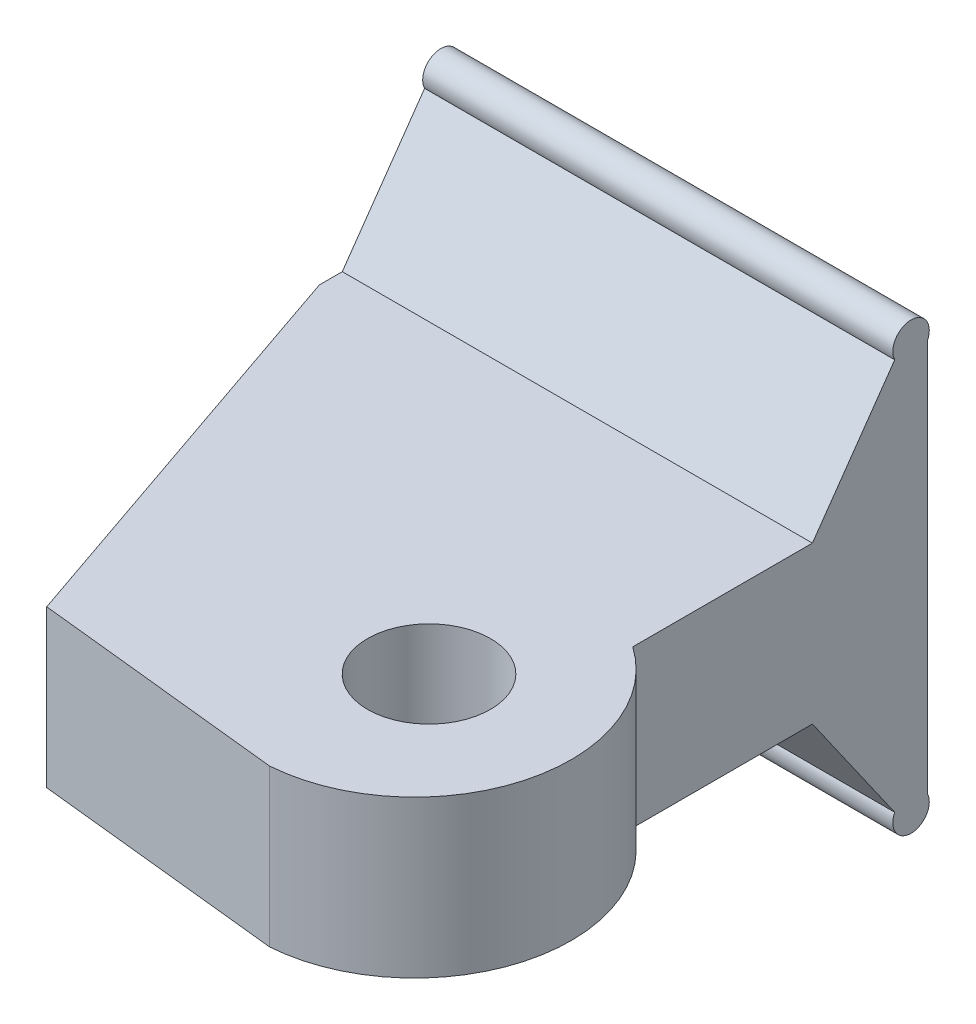
ISO-10303-21;
HEADER;
FILE_DESCRIPTION(('STEP AP214'),'2;1');
FILE_NAME('part.step','',(''),(''),'','','');
FILE_SCHEMA(('AUTOMOTIVE_DESIGN { 1 0 10303 214 1 1 1 1 }'));
ENDSEC;
DATA;
#1=APPLICATION_CONTEXT('core data for automotive mechanical design processes');
#2=APPLICATION_PROTOCOL_DEFINITION('international standard','automotive_design',2000,#1);
#3=PRODUCT_CONTEXT('',#1,'mechanical');
#4=PRODUCT('Part','Part','',(#3));
#5=PRODUCT_RELATED_PRODUCT_CATEGORY('part','',(#4));
#6=PRODUCT_DEFINITION_FORMATION('','',#4);
#7=PRODUCT_DEFINITION_CONTEXT('part definition',#1,'design');
#8=PRODUCT_DEFINITION('design','',#6,#7);
#9=PRODUCT_DEFINITION_SHAPE('','',#8);
#10=(LENGTH_UNIT() NAMED_UNIT(*) SI_UNIT(.MILLI.,.METRE.));
#11=(NAMED_UNIT(*) PLANE_ANGLE_UNIT() SI_UNIT($,.RADIAN.));
#12=(NAMED_UNIT(*) SI_UNIT($,.STERADIAN.) SOLID_ANGLE_UNIT());
#13=UNCERTAINTY_MEASURE_WITH_UNIT(LENGTH_MEASURE(1.E-05),#10,'distance_accuracy_value','');
#14=(GEOMETRIC_REPRESENTATION_CONTEXT(3) GLOBAL_UNCERTAINTY_ASSIGNED_CONTEXT((#13)) GLOBAL_UNIT_ASSIGNED_CONTEXT((#10,
#11,#12)) REPRESENTATION_CONTEXT('',''));
#15=CARTESIAN_POINT('',(0.,0.,0.));
#16=DIRECTION('',(0.,0.,1.));
#17=DIRECTION('',(1.,0.,0.));
#18=AXIS2_PLACEMENT_3D('',#15,#16,#17);
#19=CARTESIAN_POINT('',(12.7,6.35,0.));
#20=DIRECTION('',(-1.,0.,0.));
#21=DIRECTION('',(0.,0.,1.));
#22=AXIS2_PLACEMENT_3D('',#19,#20,#21);
#23=PLANE('',#22);
#24=DIRECTION('',(0.,0.,-1.));
#25=VECTOR('',#24,1.);
#26=CARTESIAN_POINT('',(12.7,0.,0.));
#27=LINE('',#26,#25);
#28=CARTESIAN_POINT('',(12.7,0.,6.35000000000004));
#29=VERTEX_POINT('',#28);
#30=CARTESIAN_POINT('',(12.7,0.,-0.930230236636228));
#31=VERTEX_POINT('',#30);
#32=EDGE_CURVE('E174',#29,#31,#27,.T.);
#33=ORIENTED_EDGE('',*,*,#32,.T.);
#34=DIRECTION('',(0.,-0.819152044288994,-0.573576436351044));
#35=VECTOR('',#34,1.);
#36=CARTESIAN_POINT('',(12.7,4.69797919955852,2.35933021324706));
#37=LINE('',#36,#35);
#38=CARTESIAN_POINT('',(12.7,-4.76455023673562,-4.26640422857733));
#39=VERTEX_POINT('',#38);
#40=EDGE_CURVE('E149',#31,#39,#37,.T.);
#41=ORIENTED_EDGE('',*,*,#40,.T.);
#42=CARTESIAN_POINT('',(12.7,-5.09493199240286,-4.92720211428867));
#43=DIRECTION('',(-1.,0.,0.));
#44=DIRECTION('',(0.,0.,1.));
#45=AXIS2_PLACEMENT_3D('',#42,#43,#44);
#46=CIRCLE('',#45,0.738786809734945);
#47=CARTESIAN_POINT('',(12.7,-4.76455023673562,-5.588));
#48=VERTEX_POINT('',#47);
#49=EDGE_CURVE('E107',#48,#39,#46,.T.);
#50=ORIENTED_EDGE('',*,*,#49,.F.);
#51=DIRECTION('',(0.,-1.,0.));
#52=VECTOR('',#51,1.);
#53=CARTESIAN_POINT('',(12.7,6.35,-5.588));
#54=LINE('',#53,#52);
#55=CARTESIAN_POINT('',(12.7,11.1145502367356,-5.588));
#56=VERTEX_POINT('',#55);
#57=EDGE_CURVE('E108',#56,#48,#54,.T.);
#58=ORIENTED_EDGE('',*,*,#57,.F.);
#59=CARTESIAN_POINT('',(12.7,11.4449319924028,-4.92720211428868));
#60=DIRECTION('',(-1.,0.,0.));
#61=DIRECTION('',(0.,0.,1.));
#62=AXIS2_PLACEMENT_3D('',#59,#60,#61);
#63=CIRCLE('',#62,0.738786809734944);
#64=CARTESIAN_POINT('',(12.7,11.1145502367356,-4.26640422857735));
#65=VERTEX_POINT('',#64);
#66=EDGE_CURVE('E137',#56,#65,#63,.F.);
#67=ORIENTED_EDGE('',*,*,#66,.T.);
#68=DIRECTION('',(0.,-0.819152044288991,0.573576436351047));
#69=VECTOR('',#68,1.);
#70=CARTESIAN_POINT('',(12.7,5.91293475550048,-0.624193857748199));
#71=LINE('',#70,#69);
#72=CARTESIAN_POINT('',(12.7,6.35,-0.930230236636228));
#73=VERTEX_POINT('',#72);
#74=EDGE_CURVE('E146',#65,#73,#71,.T.);
#75=ORIENTED_EDGE('',*,*,#74,.T.);
#76=DIRECTION('',(0.,0.,-1.));
#77=VECTOR('',#76,1.);
#78=CARTESIAN_POINT('',(12.7,6.35,0.));
#79=LINE('',#78,#77);
#80=CARTESIAN_POINT('',(12.7,6.35,6.35000000000004));
#81=VERTEX_POINT('',#80);
#82=EDGE_CURVE('E164',#81,#73,#79,.T.);
#83=ORIENTED_EDGE('',*,*,#82,.F.);
#84=DIRECTION('',(0.,-1.,0.));
#85=VECTOR('',#84,1.);
#86=CARTESIAN_POINT('',(12.7,6.35,6.35000000000004));
#87=LINE('',#86,#85);
#88=EDGE_CURVE('E125',#81,#29,#87,.T.);
#89=ORIENTED_EDGE('',*,*,#88,.T.);
#90=EDGE_LOOP('',(#33,#41,#50,#58,#67,#75,#83,#89));
#91=FACE_BOUND('',#90,.T.);
#92=ADVANCED_FACE('F35',(#91),#23,.F.);
#93=CARTESIAN_POINT('',(-6.35,12.9055102958205,0.));
#94=DIRECTION('',(1.,0.,0.));
#95=DIRECTION('',(0.,0.,-1.));
#96=AXIS2_PLACEMENT_3D('',#93,#94,#95);
#97=PLANE('',#96);
#98=DIRECTION('',(0.,0.,-1.));
#99=VECTOR('',#98,1.);
#100=CARTESIAN_POINT('',(-6.35,0.,2.6473274978281E-13));
#101=LINE('',#100,#99);
#102=CARTESIAN_POINT('',(-6.35,0.,0.));
#103=VERTEX_POINT('',#102);
#104=CARTESIAN_POINT('',(-6.35,0.,-0.930230236636228));
#105=VERTEX_POINT('',#104);
#106=EDGE_CURVE('E11',#103,#105,#101,.T.);
#107=ORIENTED_EDGE('',*,*,#106,.F.);
#108=DIRECTION('',(0.,-1.,0.));
#109=VECTOR('',#108,1.);
#110=CARTESIAN_POINT('',(-6.35,12.9055102958205,0.));
#111=LINE('',#110,#109);
#112=CARTESIAN_POINT('',(-6.35,6.35,0.));
#113=VERTEX_POINT('',#112);
#114=EDGE_CURVE('E152',#113,#103,#111,.T.);
#115=ORIENTED_EDGE('',*,*,#114,.F.);
#116=DIRECTION('',(0.,0.,-1.));
#117=VECTOR('',#116,1.);
#118=CARTESIAN_POINT('',(-6.35,6.35,0.));
#119=LINE('',#118,#117);
#120=CARTESIAN_POINT('',(-6.35,6.35,-0.930230236636228));
#121=VERTEX_POINT('',#120);
#122=EDGE_CURVE('E113',#113,#121,#119,.T.);
#123=ORIENTED_EDGE('',*,*,#122,.T.);
#124=DIRECTION('',(0.,0.819152044288991,-0.573576436351047));
#125=VECTOR('',#124,1.);
#126=CARTESIAN_POINT('',(-6.35,10.3117481888855,-3.70427618298251));
#127=LINE('',#126,#125);
#128=CARTESIAN_POINT('',(-6.35,11.1145502367356,-4.26640422857735));
#129=VERTEX_POINT('',#128);
#130=EDGE_CURVE('E115',#121,#129,#127,.T.);
#131=ORIENTED_EDGE('',*,*,#130,.T.);
#132=CARTESIAN_POINT('',(-6.35,11.4449319924028,-4.92720211428868));
#133=DIRECTION('',(-1.,0.,0.));
#134=DIRECTION('',(0.,0.,1.));
#135=AXIS2_PLACEMENT_3D('',#132,#133,#134);
#136=CIRCLE('',#135,0.738786809734944);
#137=CARTESIAN_POINT('',(-6.35,11.1145502367356,-5.588));
#138=VERTEX_POINT('',#137);
#139=EDGE_CURVE('E121',#129,#138,#136,.T.);
#140=ORIENTED_EDGE('',*,*,#139,.T.);
#141=DIRECTION('',(0.,1.,0.));
#142=VECTOR('',#141,1.);
#143=CARTESIAN_POINT('',(-6.35,0.,-5.588));
#144=LINE('',#143,#142);
#145=CARTESIAN_POINT('',(-6.35,-4.76455023673562,-5.588));
#146=VERTEX_POINT('',#145);
#147=EDGE_CURVE('E112',#146,#138,#144,.T.);
#148=ORIENTED_EDGE('',*,*,#147,.F.);
#149=CARTESIAN_POINT('',(-6.35,-5.09493199240286,-4.92720211428867));
#150=DIRECTION('',(-1.,0.,0.));
#151=DIRECTION('',(0.,0.,1.));
#152=AXIS2_PLACEMENT_3D('',#149,#150,#151);
#153=CIRCLE('',#152,0.738786809734945);
#154=CARTESIAN_POINT('',(-6.35,-4.76455023673562,-4.26640422857733));
#155=VERTEX_POINT('',#154);
#156=EDGE_CURVE('E39',#155,#146,#153,.F.);
#157=ORIENTED_EDGE('',*,*,#156,.F.);
#158=DIRECTION('',(0.,0.819152044288994,0.573576436351044));
#159=VECTOR('',#158,1.);
#160=CARTESIAN_POINT('',(-6.35,9.0967926329435,5.43941253848134));
#161=LINE('',#160,#159);
#162=EDGE_CURVE('E44',#155,#105,#161,.T.);
#163=ORIENTED_EDGE('',*,*,#162,.T.);
#164=EDGE_LOOP('',(#107,#115,#123,#131,#140,#148,#157,#163));
#165=FACE_BOUND('',#164,.T.);
#166=ADVANCED_FACE('F110',(#165),#97,.F.);
#167=CARTESIAN_POINT('',(9.06408672353238,6.35,11.5560190785289));
#168=DIRECTION('',(0.,1.,0.));
#169=DIRECTION('',(0.,0.,1.));
#170=AXIS2_PLACEMENT_3D('',#167,#168,#169);
#171=PLANE('',#170);
#172=CARTESIAN_POINT('',(9.06408672353238,6.35,11.5560190785289));
#173=DIRECTION('',(0.,1.,0.));
#174=DIRECTION('',(0.,0.,1.));
#175=AXIS2_PLACEMENT_3D('',#172,#173,#174);
#176=CIRCLE('',#175,6.35);
#177=CARTESIAN_POINT('',(9.52499999999998,6.35,17.889269346091));
#178=VERTEX_POINT('',#177);
#179=EDGE_CURVE('E162',#178,#81,#176,.T.);
#180=ORIENTED_EDGE('',*,*,#179,.T.);
#181=ORIENTED_EDGE('',*,*,#82,.T.);
#182=DIRECTION('',(-1.,0.,0.));
#183=VECTOR('',#182,1.);
#184=CARTESIAN_POINT('',(15.4140867235324,6.35,-0.930230236636228));
#185=LINE('',#184,#183);
#186=EDGE_CURVE('E140',#73,#121,#185,.T.);
#187=ORIENTED_EDGE('',*,*,#186,.T.);
#188=ORIENTED_EDGE('',*,*,#122,.F.);
#189=DIRECTION('',(0.324619143877709,0.,0.945844813607446));
#190=VECTOR('',#189,1.);
#191=CARTESIAN_POINT('',(-0.578271621854337,6.35,16.8171207859404));
#192=LINE('',#191,#190);
#193=CARTESIAN_POINT('',(-0.578271621854337,6.35,16.8171207859404));
#194=VERTEX_POINT('',#193);
#195=EDGE_CURVE('E168',#113,#194,#192,.T.);
#196=ORIENTED_EDGE('',*,*,#195,.T.);
#197=DIRECTION('',(0.994416498214008,0.,0.105526433085695));
#198=VECTOR('',#197,1.);
#199=CARTESIAN_POINT('',(9.52499999999998,6.35,17.889269346091));
#200=LINE('',#199,#198);
#201=EDGE_CURVE('E61',#194,#178,#200,.T.);
#202=ORIENTED_EDGE('',*,*,#201,.T.);
#203=EDGE_LOOP('',(#180,#181,#187,#188,#196,#202));
#204=FACE_BOUND('',#203,.T.);
#205=CARTESIAN_POINT('',(9.52499999999998,6.35,11.4299999999999));
#206=DIRECTION('',(0.,1.,0.));
#207=DIRECTION('',(0.,0.,1.));
#208=AXIS2_PLACEMENT_3D('',#205,#206,#207);
#209=CIRCLE('',#208,2.4892);
#210=CARTESIAN_POINT('',(9.52499999999998,6.35,13.9191999999999));
#211=VERTEX_POINT('',#210);
#212=EDGE_CURVE('E156',#211,#211,#209,.T.);
#213=ORIENTED_EDGE('',*,*,#212,.F.);
#214=EDGE_LOOP('',(#213));
#215=FACE_BOUND('',#214,.T.);
#216=ADVANCED_FACE('F203',(#204,#215),#171,.T.);
#217=CARTESIAN_POINT('',(9.06408672353238,0.,11.5560190785289));
#218=DIRECTION('',(0.,1.,0.));
#219=DIRECTION('',(0.,0.,1.));
#220=AXIS2_PLACEMENT_3D('',#217,#218,#219);
#221=PLANE('',#220);
#222=CARTESIAN_POINT('',(9.06408672353238,0.,11.5560190785289));
#223=DIRECTION('',(0.,1.,0.));
#224=DIRECTION('',(0.,0.,1.));
#225=AXIS2_PLACEMENT_3D('',#222,#223,#224);
#226=CIRCLE('',#225,6.35);
#227=CARTESIAN_POINT('',(9.52499999999998,0.,17.889269346091));
#228=VERTEX_POINT('',#227);
#229=EDGE_CURVE('E159',#228,#29,#226,.T.);
#230=ORIENTED_EDGE('',*,*,#229,.F.);
#231=DIRECTION('',(0.994416498214008,0.,0.105526433085695));
#232=VECTOR('',#231,1.);
#233=CARTESIAN_POINT('',(9.52499999999998,0.,17.889269346091));
#234=LINE('',#233,#232);
#235=CARTESIAN_POINT('',(-0.578271621854337,0.,16.8171207859404));
#236=VERTEX_POINT('',#235);
#237=EDGE_CURVE('E165',#236,#228,#234,.T.);
#238=ORIENTED_EDGE('',*,*,#237,.F.);
#239=DIRECTION('',(0.324619143877709,0.,0.945844813607446));
#240=VECTOR('',#239,1.);
#241=CARTESIAN_POINT('',(-0.578271621854337,0.,16.8171207859404));
#242=LINE('',#241,#240);
#243=EDGE_CURVE('E177',#103,#236,#242,.T.);
#244=ORIENTED_EDGE('',*,*,#243,.F.);
#245=ORIENTED_EDGE('',*,*,#106,.T.);
#246=DIRECTION('',(-1.,0.,0.));
#247=VECTOR('',#246,1.);
#248=CARTESIAN_POINT('',(15.4140867235324,0.,-0.930230236636228));
#249=LINE('',#248,#247);
#250=EDGE_CURVE('E97',#31,#105,#249,.T.);
#251=ORIENTED_EDGE('',*,*,#250,.F.);
#252=ORIENTED_EDGE('',*,*,#32,.F.);
#253=EDGE_LOOP('',(#230,#238,#244,#245,#251,#252));
#254=FACE_BOUND('',#253,.T.);
#255=CARTESIAN_POINT('',(9.52499999999998,0.,11.4299999999999));
#256=DIRECTION('',(0.,1.,0.));
#257=DIRECTION('',(0.,0.,1.));
#258=AXIS2_PLACEMENT_3D('',#255,#256,#257);
#259=CIRCLE('',#258,2.4892);
#260=CARTESIAN_POINT('',(9.52499999999998,0.,13.9191999999999));
#261=VERTEX_POINT('',#260);
#262=EDGE_CURVE('E155',#261,#261,#259,.T.);
#263=ORIENTED_EDGE('',*,*,#262,.T.);
#264=EDGE_LOOP('',(#263));
#265=FACE_BOUND('',#264,.T.);
#266=ADVANCED_FACE('F194',(#254,#265),#221,.F.);
#267=CARTESIAN_POINT('',(9.06408672353238,6.35,11.5560190785289));
#268=DIRECTION('',(0.,-1.,0.));
#269=DIRECTION('',(0.,0.,-1.));
#270=AXIS2_PLACEMENT_3D('',#267,#268,#269);
#271=CYLINDRICAL_SURFACE('',#270,6.35);
#272=ORIENTED_EDGE('',*,*,#229,.T.);
#273=ORIENTED_EDGE('',*,*,#88,.F.);
#274=ORIENTED_EDGE('',*,*,#179,.F.);
#275=DIRECTION('',(0.,-1.,0.));
#276=VECTOR('',#275,1.);
#277=CARTESIAN_POINT('',(9.52499999999998,6.35,17.889269346091));
#278=LINE('',#277,#276);
#279=EDGE_CURVE('E171',#178,#228,#278,.T.);
#280=ORIENTED_EDGE('',*,*,#279,.T.);
#281=EDGE_LOOP('',(#272,#273,#274,#280));
#282=FACE_BOUND('',#281,.T.);
#283=ADVANCED_FACE('F37',(#282),#271,.T.);
#284=CARTESIAN_POINT('',(-0.578271621854337,6.35,16.8171207859404));
#285=DIRECTION('',(0.945844813607445,0.,-0.324619143877709));
#286=DIRECTION('',(-0.324619143877709,0.,-0.945844813607446));
#287=AXIS2_PLACEMENT_3D('',#284,#285,#286);
#288=PLANE('',#287);
#289=ORIENTED_EDGE('',*,*,#195,.F.);
#290=ORIENTED_EDGE('',*,*,#114,.T.);
#291=ORIENTED_EDGE('',*,*,#243,.T.);
#292=DIRECTION('',(0.,-1.,0.));
#293=VECTOR('',#292,1.);
#294=CARTESIAN_POINT('',(-0.578271621854337,6.35,16.8171207859404));
#295=LINE('',#294,#293);
#296=EDGE_CURVE('E182',#194,#236,#295,.T.);
#297=ORIENTED_EDGE('',*,*,#296,.F.);
#298=EDGE_LOOP('',(#289,#290,#291,#297));
#299=FACE_BOUND('',#298,.T.);
#300=ADVANCED_FACE('F221',(#299),#288,.F.);
#301=CARTESIAN_POINT('',(9.52499999999998,6.35,17.889269346091));
#302=DIRECTION('',(0.105526433085695,0.,-0.994416498214008));
#303=DIRECTION('',(-0.994416498214008,0.,-0.105526433085695));
#304=AXIS2_PLACEMENT_3D('',#301,#302,#303);
#305=PLANE('',#304);
#306=ORIENTED_EDGE('',*,*,#237,.T.);
#307=ORIENTED_EDGE('',*,*,#279,.F.);
#308=ORIENTED_EDGE('',*,*,#201,.F.);
#309=ORIENTED_EDGE('',*,*,#296,.T.);
#310=EDGE_LOOP('',(#306,#307,#308,#309));
#311=FACE_BOUND('',#310,.T.);
#312=ADVANCED_FACE('F224',(#311),#305,.F.);
#313=CARTESIAN_POINT('',(9.52499999999998,6.35,11.4299999999999));
#314=DIRECTION('',(0.,-1.,0.));
#315=DIRECTION('',(0.,0.,-1.));
#316=AXIS2_PLACEMENT_3D('',#313,#314,#315);
#317=CYLINDRICAL_SURFACE('',#316,2.4892);
#318=ORIENTED_EDGE('',*,*,#212,.T.);
#319=EDGE_LOOP('',(#318));
#320=FACE_BOUND('',#319,.T.);
#321=ORIENTED_EDGE('',*,*,#262,.F.);
#322=EDGE_LOOP('',(#321));
#323=FACE_BOUND('',#322,.T.);
#324=ADVANCED_FACE('F226',(#320,#323),#317,.F.);
#325=CARTESIAN_POINT('',(15.4140867235324,-5.09493199240286,-4.92720211428867));
#326=DIRECTION('',(-1.,0.,0.));
#327=DIRECTION('',(0.,0.,1.));
#328=AXIS2_PLACEMENT_3D('',#325,#326,#327);
#329=CYLINDRICAL_SURFACE('',#328,0.738786809734945);
#330=ORIENTED_EDGE('',*,*,#49,.T.);
#331=DIRECTION('',(-1.,0.,0.));
#332=VECTOR('',#331,1.);
#333=CARTESIAN_POINT('',(15.4140867235324,-4.76455023673561,-4.26640422857733));
#334=LINE('',#333,#332);
#335=EDGE_CURVE('E93',#39,#155,#334,.T.);
#336=ORIENTED_EDGE('',*,*,#335,.T.);
#337=ORIENTED_EDGE('',*,*,#156,.T.);
#338=DIRECTION('',(-1.,0.,0.));
#339=VECTOR('',#338,1.);
#340=CARTESIAN_POINT('',(15.4140867235324,-4.76455023673562,-5.588));
#341=LINE('',#340,#339);
#342=EDGE_CURVE('E52',#48,#146,#341,.T.);
#343=ORIENTED_EDGE('',*,*,#342,.F.);
#344=EDGE_LOOP('',(#330,#336,#337,#343));
#345=FACE_BOUND('',#344,.T.);
#346=ADVANCED_FACE('F104',(#345),#329,.T.);
#347=CARTESIAN_POINT('',(15.4140867235324,0.437065244499489,-0.624193857748204));
#348=DIRECTION('',(0.,0.573576436351044,-0.819152044288993));
#349=DIRECTION('',(0.,0.819152044288994,0.573576436351044));
#350=AXIS2_PLACEMENT_3D('',#347,#348,#349);
#351=PLANE('',#350);
#352=ORIENTED_EDGE('',*,*,#250,.T.);
#353=ORIENTED_EDGE('',*,*,#162,.F.);
#354=ORIENTED_EDGE('',*,*,#335,.F.);
#355=ORIENTED_EDGE('',*,*,#40,.F.);
#356=EDGE_LOOP('',(#352,#353,#354,#355));
#357=FACE_BOUND('',#356,.T.);
#358=ADVANCED_FACE('F91',(#357),#351,.F.);
#359=CARTESIAN_POINT('',(15.4140867235324,1.65202080044151,2.35933021324705));
#360=DIRECTION('',(0.,-0.573576436351047,-0.819152044288991));
#361=DIRECTION('',(0.,0.819152044288991,-0.573576436351047));
#362=AXIS2_PLACEMENT_3D('',#359,#360,#361);
#363=PLANE('',#362);
#364=DIRECTION('',(-1.,0.,0.));
#365=VECTOR('',#364,1.);
#366=CARTESIAN_POINT('',(15.4140867235324,11.1145502367356,-4.26640422857735));
#367=LINE('',#366,#365);
#368=EDGE_CURVE('E133',#65,#129,#367,.T.);
#369=ORIENTED_EDGE('',*,*,#368,.T.);
#370=ORIENTED_EDGE('',*,*,#130,.F.);
#371=ORIENTED_EDGE('',*,*,#186,.F.);
#372=ORIENTED_EDGE('',*,*,#74,.F.);
#373=EDGE_LOOP('',(#369,#370,#371,#372));
#374=FACE_BOUND('',#373,.T.);
#375=ADVANCED_FACE('F210',(#374),#363,.F.);
#376=CARTESIAN_POINT('',(15.4140867235324,11.4449319924028,-4.92720211428868));
#377=DIRECTION('',(-1.,0.,0.));
#378=DIRECTION('',(0.,0.,1.));
#379=AXIS2_PLACEMENT_3D('',#376,#377,#378);
#380=CYLINDRICAL_SURFACE('',#379,0.738786809734944);
#381=DIRECTION('',(-1.,0.,0.));
#382=VECTOR('',#381,1.);
#383=CARTESIAN_POINT('',(15.4140867235324,11.1145502367356,-5.588));
#384=LINE('',#383,#382);
#385=EDGE_CURVE('E136',#56,#138,#384,.T.);
#386=ORIENTED_EDGE('',*,*,#385,.T.);
#387=ORIENTED_EDGE('',*,*,#139,.F.);
#388=ORIENTED_EDGE('',*,*,#368,.F.);
#389=ORIENTED_EDGE('',*,*,#66,.F.);
#390=EDGE_LOOP('',(#386,#387,#388,#389));
#391=FACE_BOUND('',#390,.T.);
#392=ADVANCED_FACE('F131',(#391),#380,.T.);
#393=CARTESIAN_POINT('',(15.4140867235324,0.,-5.588));
#394=DIRECTION('',(0.,0.,-1.));
#395=DIRECTION('',(0.,1.,0.));
#396=AXIS2_PLACEMENT_3D('',#393,#394,#395);
#397=PLANE('',#396);
#398=ORIENTED_EDGE('',*,*,#57,.T.);
#399=ORIENTED_EDGE('',*,*,#342,.T.);
#400=ORIENTED_EDGE('',*,*,#147,.T.);
#401=ORIENTED_EDGE('',*,*,#385,.F.);
#402=EDGE_LOOP('',(#398,#399,#400,#401));
#403=FACE_BOUND('',#402,.T.);
#404=ADVANCED_FACE('F295',(#403),#397,.T.);
#405=CLOSED_SHELL('',(#92,#166,#216,#266,#283,#300,#312,#324,#346,#358,#375,#392,#404));
#406=MANIFOLD_SOLID_BREP('B2',#405);
#407=ADVANCED_BREP_SHAPE_REPRESENTATION('',(#18,#406),#14);
#408=SHAPE_DEFINITION_REPRESENTATION(#9,#407);
ENDSEC;
END-ISO-10303-21;
